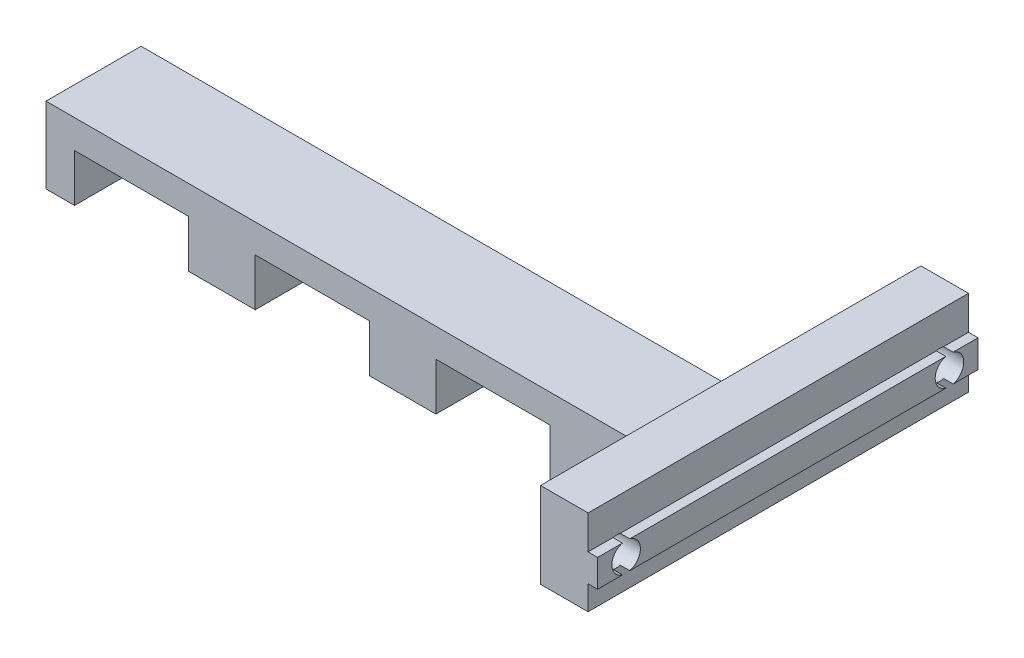
ISO-10303-21;
HEADER;
FILE_DESCRIPTION(('STEP AP214'),'2;1');
FILE_NAME('part.step','',(''),(''),'','','');
FILE_SCHEMA(('AUTOMOTIVE_DESIGN { 1 0 10303 214 1 1 1 1 }'));
ENDSEC;
DATA;
#1=APPLICATION_CONTEXT('core data for automotive mechanical design processes');
#2=APPLICATION_PROTOCOL_DEFINITION('international standard','automotive_design',2000,#1);
#3=PRODUCT_CONTEXT('',#1,'mechanical');
#4=PRODUCT('Part','Part','',(#3));
#5=PRODUCT_RELATED_PRODUCT_CATEGORY('part','',(#4));
#6=PRODUCT_DEFINITION_FORMATION('','',#4);
#7=PRODUCT_DEFINITION_CONTEXT('part definition',#1,'design');
#8=PRODUCT_DEFINITION('design','',#6,#7);
#9=PRODUCT_DEFINITION_SHAPE('','',#8);
#10=(LENGTH_UNIT() NAMED_UNIT(*) SI_UNIT(.MILLI.,.METRE.));
#11=(NAMED_UNIT(*) PLANE_ANGLE_UNIT() SI_UNIT($,.RADIAN.));
#12=(NAMED_UNIT(*) SI_UNIT($,.STERADIAN.) SOLID_ANGLE_UNIT());
#13=UNCERTAINTY_MEASURE_WITH_UNIT(LENGTH_MEASURE(1.E-05),#10,'distance_accuracy_value','');
#14=(GEOMETRIC_REPRESENTATION_CONTEXT(3) GLOBAL_UNCERTAINTY_ASSIGNED_CONTEXT((#13)) GLOBAL_UNIT_ASSIGNED_CONTEXT((#10,
#11,#12)) REPRESENTATION_CONTEXT('',''));
#15=CARTESIAN_POINT('',(0.,0.,0.));
#16=DIRECTION('',(0.,0.,1.));
#17=DIRECTION('',(1.,0.,0.));
#18=AXIS2_PLACEMENT_3D('',#15,#16,#17);
#19=CARTESIAN_POINT('',(73.,10.45,20.));
#20=DIRECTION('',(-1.,0.,0.));
#21=DIRECTION('',(0.,0.,1.));
#22=AXIS2_PLACEMENT_3D('',#19,#20,#21);
#23=PLANE('',#22);
#24=DIRECTION('',(0.,0.,-1.));
#25=VECTOR('',#24,1.);
#26=CARTESIAN_POINT('',(73.,10.45,20.));
#27=LINE('',#26,#25);
#28=CARTESIAN_POINT('',(73.,10.45,-17.3840572873934));
#29=VERTEX_POINT('',#28);
#30=CARTESIAN_POINT('',(73.,10.45,-20.));
#31=VERTEX_POINT('',#30);
#32=EDGE_CURVE('E286',#29,#31,#27,.T.);
#33=ORIENTED_EDGE('',*,*,#32,.F.);
#34=CARTESIAN_POINT('',(73.,9.,-17.));
#35=DIRECTION('',(1.,0.,0.));
#36=DIRECTION('',(0.,0.,-1.));
#37=AXIS2_PLACEMENT_3D('',#34,#35,#36);
#38=CIRCLE('',#37,1.5);
#39=CARTESIAN_POINT('',(73.,7.55,-17.3840572873934));
#40=VERTEX_POINT('',#39);
#41=EDGE_CURVE('E269',#40,#29,#38,.T.);
#42=ORIENTED_EDGE('',*,*,#41,.F.);
#43=DIRECTION('',(0.,0.,-1.));
#44=VECTOR('',#43,1.);
#45=CARTESIAN_POINT('',(73.,7.55,20.));
#46=LINE('',#45,#44);
#47=CARTESIAN_POINT('',(73.,7.55,-20.));
#48=VERTEX_POINT('',#47);
#49=EDGE_CURVE('E304',#40,#48,#46,.T.);
#50=ORIENTED_EDGE('',*,*,#49,.T.);
#51=DIRECTION('',(0.,1.,0.));
#52=VECTOR('',#51,1.);
#53=CARTESIAN_POINT('',(73.,10.45,-20.));
#54=LINE('',#53,#52);
#55=EDGE_CURVE('E292',#48,#31,#54,.T.);
#56=ORIENTED_EDGE('',*,*,#55,.T.);
#57=EDGE_LOOP('',(#33,#42,#50,#56));
#58=FACE_BOUND('',#57,.T.);
#59=ADVANCED_FACE('F33',(#58),#23,.F.);
#60=CARTESIAN_POINT('',(72.,10.45,20.));
#61=DIRECTION('',(0.,-1.,0.));
#62=DIRECTION('',(0.,0.,-1.));
#63=AXIS2_PLACEMENT_3D('',#60,#61,#62);
#64=PLANE('',#63);
#65=DIRECTION('',(0.,0.,-1.));
#66=VECTOR('',#65,1.);
#67=CARTESIAN_POINT('',(72.,10.45,20.));
#68=LINE('',#67,#66);
#69=CARTESIAN_POINT('',(72.,10.45,-17.3840572873934));
#70=VERTEX_POINT('',#69);
#71=CARTESIAN_POINT('',(72.,10.45,-20.));
#72=VERTEX_POINT('',#71);
#73=EDGE_CURVE('E288',#70,#72,#68,.T.);
#74=ORIENTED_EDGE('',*,*,#73,.F.);
#75=DIRECTION('',(1.,0.,0.));
#76=VECTOR('',#75,1.);
#77=CARTESIAN_POINT('',(43.,10.45,-17.3840572873934));
#78=LINE('',#77,#76);
#79=EDGE_CURVE('E273',#70,#29,#78,.T.);
#80=ORIENTED_EDGE('',*,*,#79,.T.);
#81=ORIENTED_EDGE('',*,*,#32,.T.);
#82=DIRECTION('',(-1.,0.,0.));
#83=VECTOR('',#82,1.);
#84=CARTESIAN_POINT('',(72.,10.45,-20.));
#85=LINE('',#84,#83);
#86=EDGE_CURVE('E515',#31,#72,#85,.T.);
#87=ORIENTED_EDGE('',*,*,#86,.T.);
#88=EDGE_LOOP('',(#74,#80,#81,#87));
#89=FACE_BOUND('',#88,.T.);
#90=ADVANCED_FACE('F284',(#89),#64,.F.);
#91=CARTESIAN_POINT('',(73.,7.55,20.));
#92=DIRECTION('',(0.,1.,0.));
#93=DIRECTION('',(0.,0.,1.));
#94=AXIS2_PLACEMENT_3D('',#91,#92,#93);
#95=PLANE('',#94);
#96=DIRECTION('',(0.,0.,-1.));
#97=VECTOR('',#96,1.);
#98=CARTESIAN_POINT('',(72.,7.55,20.));
#99=LINE('',#98,#97);
#100=CARTESIAN_POINT('',(72.,7.55,16.6159427126066));
#101=VERTEX_POINT('',#100);
#102=CARTESIAN_POINT('',(72.,7.55,-16.6159427126066));
#103=VERTEX_POINT('',#102);
#104=EDGE_CURVE('E320',#101,#103,#99,.T.);
#105=ORIENTED_EDGE('',*,*,#104,.T.);
#106=DIRECTION('',(1.,0.,0.));
#107=VECTOR('',#106,1.);
#108=CARTESIAN_POINT('',(43.,7.55,-16.6159427126066));
#109=LINE('',#108,#107);
#110=CARTESIAN_POINT('',(73.,7.55,-16.6159427126066));
#111=VERTEX_POINT('',#110);
#112=EDGE_CURVE('E545',#103,#111,#109,.T.);
#113=ORIENTED_EDGE('',*,*,#112,.T.);
#114=CARTESIAN_POINT('',(73.,7.55,16.6159427126066));
#115=VERTEX_POINT('',#114);
#116=EDGE_CURVE('E309',#115,#111,#46,.T.);
#117=ORIENTED_EDGE('',*,*,#116,.F.);
#118=DIRECTION('',(1.,0.,0.));
#119=VECTOR('',#118,1.);
#120=CARTESIAN_POINT('',(43.,7.55,16.6159427126066));
#121=LINE('',#120,#119);
#122=EDGE_CURVE('E557',#115,#101,#121,.F.);
#123=ORIENTED_EDGE('',*,*,#122,.T.);
#124=EDGE_LOOP('',(#105,#113,#117,#123));
#125=FACE_BOUND('',#124,.T.);
#126=ADVANCED_FACE('F681',(#125),#95,.F.);
#127=CARTESIAN_POINT('',(72.,7.55,20.));
#128=VERTEX_POINT('',#127);
#129=CARTESIAN_POINT('',(72.,7.55,17.3840572873934));
#130=VERTEX_POINT('',#129);
#131=EDGE_CURVE('E321',#128,#130,#99,.T.);
#132=ORIENTED_EDGE('',*,*,#131,.T.);
#133=DIRECTION('',(1.,0.,0.));
#134=VECTOR('',#133,1.);
#135=CARTESIAN_POINT('',(43.,7.55,17.3840572873934));
#136=LINE('',#135,#134);
#137=CARTESIAN_POINT('',(73.,7.55,17.3840572873934));
#138=VERTEX_POINT('',#137);
#139=EDGE_CURVE('E505',#130,#138,#136,.T.);
#140=ORIENTED_EDGE('',*,*,#139,.T.);
#141=CARTESIAN_POINT('',(73.,7.55,20.));
#142=VERTEX_POINT('',#141);
#143=EDGE_CURVE('E310',#142,#138,#46,.T.);
#144=ORIENTED_EDGE('',*,*,#143,.F.);
#145=DIRECTION('',(1.,0.,0.));
#146=VECTOR('',#145,1.);
#147=CARTESIAN_POINT('',(73.,7.55,20.));
#148=LINE('',#147,#146);
#149=EDGE_CURVE('E571',#128,#142,#148,.T.);
#150=ORIENTED_EDGE('',*,*,#149,.F.);
#151=EDGE_LOOP('',(#132,#140,#144,#150));
#152=FACE_BOUND('',#151,.T.);
#153=ADVANCED_FACE('F686',(#152),#95,.F.);
#154=ORIENTED_EDGE('',*,*,#116,.T.);
#155=CARTESIAN_POINT('',(73.,10.45,-16.6159427126066));
#156=VERTEX_POINT('',#155);
#157=EDGE_CURVE('E280',#156,#111,#38,.T.);
#158=ORIENTED_EDGE('',*,*,#157,.F.);
#159=CARTESIAN_POINT('',(73.,10.45,16.6159427126066));
#160=VERTEX_POINT('',#159);
#161=EDGE_CURVE('E294',#160,#156,#27,.T.);
#162=ORIENTED_EDGE('',*,*,#161,.F.);
#163=CARTESIAN_POINT('',(73.,9.,17.));
#164=DIRECTION('',(1.,0.,0.));
#165=DIRECTION('',(0.,0.,-1.));
#166=AXIS2_PLACEMENT_3D('',#163,#164,#165);
#167=CIRCLE('',#166,1.5);
#168=EDGE_CURVE('E551',#115,#160,#167,.T.);
#169=ORIENTED_EDGE('',*,*,#168,.F.);
#170=EDGE_LOOP('',(#154,#158,#162,#169));
#171=FACE_BOUND('',#170,.T.);
#172=ADVANCED_FACE('F676',(#171),#23,.F.);
#173=ORIENTED_EDGE('',*,*,#161,.T.);
#174=DIRECTION('',(1.,0.,0.));
#175=VECTOR('',#174,1.);
#176=CARTESIAN_POINT('',(43.,10.45,-16.6159427126066));
#177=LINE('',#176,#175);
#178=CARTESIAN_POINT('',(72.,10.45,-16.6159427126066));
#179=VERTEX_POINT('',#178);
#180=EDGE_CURVE('E289',#156,#179,#177,.F.);
#181=ORIENTED_EDGE('',*,*,#180,.T.);
#182=CARTESIAN_POINT('',(72.,10.45,16.6159427126066));
#183=VERTEX_POINT('',#182);
#184=EDGE_CURVE('E300',#183,#179,#68,.T.);
#185=ORIENTED_EDGE('',*,*,#184,.F.);
#186=DIRECTION('',(1.,0.,0.));
#187=VECTOR('',#186,1.);
#188=CARTESIAN_POINT('',(43.,10.45,16.6159427126066));
#189=LINE('',#188,#187);
#190=EDGE_CURVE('E536',#183,#160,#189,.T.);
#191=ORIENTED_EDGE('',*,*,#190,.T.);
#192=EDGE_LOOP('',(#173,#181,#185,#191));
#193=FACE_BOUND('',#192,.T.);
#194=ADVANCED_FACE('F535',(#193),#64,.F.);
#195=CARTESIAN_POINT('',(72.,5.,5.));
#196=DIRECTION('',(-1.,0.,0.));
#197=DIRECTION('',(0.,0.,1.));
#198=AXIS2_PLACEMENT_3D('',#195,#196,#197);
#199=PLANE('',#198);
#200=CARTESIAN_POINT('',(72.,7.55,-17.3840572873934));
#201=VERTEX_POINT('',#200);
#202=CARTESIAN_POINT('',(72.,7.55,-20.));
#203=VERTEX_POINT('',#202);
#204=EDGE_CURVE('E315',#201,#203,#99,.T.);
#205=ORIENTED_EDGE('',*,*,#204,.F.);
#206=CARTESIAN_POINT('',(72.,9.,-17.));
#207=DIRECTION('',(-1.,0.,0.));
#208=DIRECTION('',(0.,0.,1.));
#209=AXIS2_PLACEMENT_3D('',#206,#207,#208);
#210=CIRCLE('',#209,1.5);
#211=EDGE_CURVE('E542',#201,#103,#210,.T.);
#212=ORIENTED_EDGE('',*,*,#211,.T.);
#213=ORIENTED_EDGE('',*,*,#104,.F.);
#214=CARTESIAN_POINT('',(72.,9.,17.));
#215=DIRECTION('',(-1.,0.,0.));
#216=DIRECTION('',(0.,0.,1.));
#217=AXIS2_PLACEMENT_3D('',#214,#215,#216);
#218=CIRCLE('',#217,1.5);
#219=EDGE_CURVE('E560',#101,#130,#218,.T.);
#220=ORIENTED_EDGE('',*,*,#219,.T.);
#221=ORIENTED_EDGE('',*,*,#131,.F.);
#222=DIRECTION('',(0.,1.,0.));
#223=VECTOR('',#222,1.);
#224=CARTESIAN_POINT('',(72.,7.55,20.));
#225=LINE('',#224,#223);
#226=CARTESIAN_POINT('',(72.,5.,20.));
#227=VERTEX_POINT('',#226);
#228=EDGE_CURVE('E569',#227,#128,#225,.T.);
#229=ORIENTED_EDGE('',*,*,#228,.F.);
#230=DIRECTION('',(0.,0.,-1.));
#231=VECTOR('',#230,1.);
#232=CARTESIAN_POINT('',(72.,5.,5.));
#233=LINE('',#232,#231);
#234=CARTESIAN_POINT('',(72.,5.,-20.));
#235=VERTEX_POINT('',#234);
#236=EDGE_CURVE('E414',#227,#235,#233,.T.);
#237=ORIENTED_EDGE('',*,*,#236,.T.);
#238=DIRECTION('',(0.,1.,0.));
#239=VECTOR('',#238,1.);
#240=CARTESIAN_POINT('',(72.,7.55,-20.));
#241=LINE('',#240,#239);
#242=EDGE_CURVE('E502',#235,#203,#241,.T.);
#243=ORIENTED_EDGE('',*,*,#242,.T.);
#244=EDGE_LOOP('',(#205,#212,#213,#220,#221,#229,#237,#243));
#245=FACE_BOUND('',#244,.T.);
#246=ADVANCED_FACE('F716',(#245),#199,.F.);
#247=CARTESIAN_POINT('',(72.,8.00000000000001,5.));
#248=DIRECTION('',(0.,-1.,0.));
#249=DIRECTION('',(1.,0.,0.));
#250=AXIS2_PLACEMENT_3D('',#247,#248,#249);
#251=PLANE('',#250);
#252=DIRECTION('',(-1.,0.,0.));
#253=VECTOR('',#252,1.);
#254=CARTESIAN_POINT('',(72.,8.00000000000001,5.));
#255=LINE('',#254,#253);
#256=CARTESIAN_POINT('',(65.,8.00000000000001,5.));
#257=VERTEX_POINT('',#256);
#258=CARTESIAN_POINT('',(0.,8.,5.));
#259=VERTEX_POINT('',#258);
#260=EDGE_CURVE('E371',#257,#259,#255,.T.);
#261=ORIENTED_EDGE('',*,*,#260,.F.);
#262=DIRECTION('',(0.,0.,1.));
#263=VECTOR('',#262,1.);
#264=CARTESIAN_POINT('',(65.,8.00000000000001,-5.));
#265=LINE('',#264,#263);
#266=CARTESIAN_POINT('',(65.,8.00000000000001,-5.));
#267=VERTEX_POINT('',#266);
#268=EDGE_CURVE('E470',#257,#267,#265,.F.);
#269=ORIENTED_EDGE('',*,*,#268,.T.);
#270=DIRECTION('',(-1.,0.,0.));
#271=VECTOR('',#270,1.);
#272=CARTESIAN_POINT('',(72.,8.00000000000001,-5.));
#273=LINE('',#272,#271);
#274=CARTESIAN_POINT('',(0.,8.,-5.));
#275=VERTEX_POINT('',#274);
#276=EDGE_CURVE('E406',#267,#275,#273,.T.);
#277=ORIENTED_EDGE('',*,*,#276,.T.);
#278=DIRECTION('',(0.,0.,-1.));
#279=VECTOR('',#278,1.);
#280=CARTESIAN_POINT('',(0.,8.,5.));
#281=LINE('',#280,#279);
#282=EDGE_CURVE('E411',#259,#275,#281,.T.);
#283=ORIENTED_EDGE('',*,*,#282,.F.);
#284=EDGE_LOOP('',(#261,#269,#277,#283));
#285=FACE_BOUND('',#284,.T.);
#286=ADVANCED_FACE('F590',(#285),#251,.F.);
#287=CARTESIAN_POINT('',(0.,0.,5.));
#288=DIRECTION('',(0.,0.,1.));
#289=DIRECTION('',(1.,0.,0.));
#290=AXIS2_PLACEMENT_3D('',#287,#288,#289);
#291=PLANE('',#290);
#292=DIRECTION('',(1.,0.,0.));
#293=VECTOR('',#292,1.);
#294=CARTESIAN_POINT('',(60.,5.,5.));
#295=LINE('',#294,#293);
#296=CARTESIAN_POINT('',(60.,5.,5.));
#297=VERTEX_POINT('',#296);
#298=CARTESIAN_POINT('',(65.,5.,5.));
#299=VERTEX_POINT('',#298);
#300=EDGE_CURVE('E369',#297,#299,#295,.T.);
#301=ORIENTED_EDGE('',*,*,#300,.T.);
#302=DIRECTION('',(0.,1.,0.));
#303=VECTOR('',#302,1.);
#304=CARTESIAN_POINT('',(65.,0.,5.));
#305=LINE('',#304,#303);
#306=EDGE_CURVE('E472',#299,#257,#305,.T.);
#307=ORIENTED_EDGE('',*,*,#306,.T.);
#308=ORIENTED_EDGE('',*,*,#260,.T.);
#309=DIRECTION('',(0.,-1.,0.));
#310=VECTOR('',#309,1.);
#311=CARTESIAN_POINT('',(0.,8.,5.));
#312=LINE('',#311,#310);
#313=CARTESIAN_POINT('',(0.,0.,5.));
#314=VERTEX_POINT('',#313);
#315=EDGE_CURVE('E373',#259,#314,#312,.T.);
#316=ORIENTED_EDGE('',*,*,#315,.T.);
#317=DIRECTION('',(1.,0.,0.));
#318=VECTOR('',#317,1.);
#319=CARTESIAN_POINT('',(0.,0.,5.));
#320=LINE('',#319,#318);
#321=CARTESIAN_POINT('',(3.,0.,5.));
#322=VERTEX_POINT('',#321);
#323=EDGE_CURVE('E339',#314,#322,#320,.T.);
#324=ORIENTED_EDGE('',*,*,#323,.T.);
#325=DIRECTION('',(0.,1.,0.));
#326=VECTOR('',#325,1.);
#327=CARTESIAN_POINT('',(3.,0.,5.));
#328=LINE('',#327,#326);
#329=CARTESIAN_POINT('',(3.,5.,5.));
#330=VERTEX_POINT('',#329);
#331=EDGE_CURVE('E342',#322,#330,#328,.T.);
#332=ORIENTED_EDGE('',*,*,#331,.T.);
#333=DIRECTION('',(1.,0.,0.));
#334=VECTOR('',#333,1.);
#335=CARTESIAN_POINT('',(3.,5.,5.));
#336=LINE('',#335,#334);
#337=CARTESIAN_POINT('',(15.,5.,5.));
#338=VERTEX_POINT('',#337);
#339=EDGE_CURVE('E345',#330,#338,#336,.T.);
#340=ORIENTED_EDGE('',*,*,#339,.T.);
#341=DIRECTION('',(0.,-1.,0.));
#342=VECTOR('',#341,1.);
#343=CARTESIAN_POINT('',(15.,5.,5.));
#344=LINE('',#343,#342);
#345=CARTESIAN_POINT('',(15.,0.,5.));
#346=VERTEX_POINT('',#345);
#347=EDGE_CURVE('E347',#338,#346,#344,.T.);
#348=ORIENTED_EDGE('',*,*,#347,.T.);
#349=DIRECTION('',(1.,0.,0.));
#350=VECTOR('',#349,1.);
#351=CARTESIAN_POINT('',(15.,0.,5.));
#352=LINE('',#351,#350);
#353=CARTESIAN_POINT('',(22.,0.,5.));
#354=VERTEX_POINT('',#353);
#355=EDGE_CURVE('E349',#346,#354,#352,.T.);
#356=ORIENTED_EDGE('',*,*,#355,.T.);
#357=DIRECTION('',(0.,1.,0.));
#358=VECTOR('',#357,1.);
#359=CARTESIAN_POINT('',(22.,0.,5.));
#360=LINE('',#359,#358);
#361=CARTESIAN_POINT('',(22.,5.,5.));
#362=VERTEX_POINT('',#361);
#363=EDGE_CURVE('E351',#354,#362,#360,.T.);
#364=ORIENTED_EDGE('',*,*,#363,.T.);
#365=DIRECTION('',(1.,0.,0.));
#366=VECTOR('',#365,1.);
#367=CARTESIAN_POINT('',(22.,5.,5.));
#368=LINE('',#367,#366);
#369=CARTESIAN_POINT('',(34.,5.,5.));
#370=VERTEX_POINT('',#369);
#371=EDGE_CURVE('E353',#362,#370,#368,.T.);
#372=ORIENTED_EDGE('',*,*,#371,.T.);
#373=DIRECTION('',(0.,-1.,0.));
#374=VECTOR('',#373,1.);
#375=CARTESIAN_POINT('',(34.,5.,5.));
#376=LINE('',#375,#374);
#377=CARTESIAN_POINT('',(34.,0.,5.));
#378=VERTEX_POINT('',#377);
#379=EDGE_CURVE('E355',#370,#378,#376,.T.);
#380=ORIENTED_EDGE('',*,*,#379,.T.);
#381=DIRECTION('',(1.,0.,0.));
#382=VECTOR('',#381,1.);
#383=CARTESIAN_POINT('',(34.,0.,5.));
#384=LINE('',#383,#382);
#385=CARTESIAN_POINT('',(41.,0.,5.));
#386=VERTEX_POINT('',#385);
#387=EDGE_CURVE('E357',#378,#386,#384,.T.);
#388=ORIENTED_EDGE('',*,*,#387,.T.);
#389=DIRECTION('',(0.,1.,0.));
#390=VECTOR('',#389,1.);
#391=CARTESIAN_POINT('',(41.,0.,5.));
#392=LINE('',#391,#390);
#393=CARTESIAN_POINT('',(41.,5.,5.));
#394=VERTEX_POINT('',#393);
#395=EDGE_CURVE('E359',#386,#394,#392,.T.);
#396=ORIENTED_EDGE('',*,*,#395,.T.);
#397=DIRECTION('',(1.,0.,0.));
#398=VECTOR('',#397,1.);
#399=CARTESIAN_POINT('',(41.,5.,5.));
#400=LINE('',#399,#398);
#401=CARTESIAN_POINT('',(53.,5.,5.));
#402=VERTEX_POINT('',#401);
#403=EDGE_CURVE('E361',#394,#402,#400,.T.);
#404=ORIENTED_EDGE('',*,*,#403,.T.);
#405=DIRECTION('',(0.,-1.,0.));
#406=VECTOR('',#405,1.);
#407=CARTESIAN_POINT('',(53.,5.,5.));
#408=LINE('',#407,#406);
#409=CARTESIAN_POINT('',(53.,0.,5.));
#410=VERTEX_POINT('',#409);
#411=EDGE_CURVE('E363',#402,#410,#408,.T.);
#412=ORIENTED_EDGE('',*,*,#411,.T.);
#413=DIRECTION('',(1.,0.,0.));
#414=VECTOR('',#413,1.);
#415=CARTESIAN_POINT('',(53.,0.,5.));
#416=LINE('',#415,#414);
#417=CARTESIAN_POINT('',(60.,0.,5.));
#418=VERTEX_POINT('',#417);
#419=EDGE_CURVE('E365',#410,#418,#416,.T.);
#420=ORIENTED_EDGE('',*,*,#419,.T.);
#421=DIRECTION('',(0.,1.,0.));
#422=VECTOR('',#421,1.);
#423=CARTESIAN_POINT('',(60.,0.,5.));
#424=LINE('',#423,#422);
#425=EDGE_CURVE('E367',#418,#297,#424,.T.);
#426=ORIENTED_EDGE('',*,*,#425,.T.);
#427=EDGE_LOOP('',(#301,#307,#308,#316,#324,#332,#340,#348,#356,#364,#372,#380,#388,#396,#404,
#412,#420,#426));
#428=FACE_BOUND('',#427,.T.);
#429=ADVANCED_FACE('F587',(#428),#291,.T.);
#430=CARTESIAN_POINT('',(0.,0.,-5.));
#431=DIRECTION('',(0.,0.,1.));
#432=DIRECTION('',(1.,0.,0.));
#433=AXIS2_PLACEMENT_3D('',#430,#431,#432);
#434=PLANE('',#433);
#435=ORIENTED_EDGE('',*,*,#276,.F.);
#436=DIRECTION('',(0.,1.,0.));
#437=VECTOR('',#436,1.);
#438=CARTESIAN_POINT('',(65.,5.,-5.));
#439=LINE('',#438,#437);
#440=CARTESIAN_POINT('',(65.,5.,-5.));
#441=VERTEX_POINT('',#440);
#442=EDGE_CURVE('E50',#267,#441,#439,.F.);
#443=ORIENTED_EDGE('',*,*,#442,.T.);
#444=DIRECTION('',(1.,0.,0.));
#445=VECTOR('',#444,1.);
#446=CARTESIAN_POINT('',(60.,5.,-5.));
#447=LINE('',#446,#445);
#448=CARTESIAN_POINT('',(60.,5.,-5.));
#449=VERTEX_POINT('',#448);
#450=EDGE_CURVE('E404',#449,#441,#447,.T.);
#451=ORIENTED_EDGE('',*,*,#450,.F.);
#452=DIRECTION('',(0.,1.,0.));
#453=VECTOR('',#452,1.);
#454=CARTESIAN_POINT('',(60.,0.,-5.));
#455=LINE('',#454,#453);
#456=CARTESIAN_POINT('',(60.,0.,-5.));
#457=VERTEX_POINT('',#456);
#458=EDGE_CURVE('E402',#457,#449,#455,.T.);
#459=ORIENTED_EDGE('',*,*,#458,.F.);
#460=DIRECTION('',(1.,0.,0.));
#461=VECTOR('',#460,1.);
#462=CARTESIAN_POINT('',(53.,0.,-5.));
#463=LINE('',#462,#461);
#464=CARTESIAN_POINT('',(53.,0.,-5.));
#465=VERTEX_POINT('',#464);
#466=EDGE_CURVE('E400',#465,#457,#463,.T.);
#467=ORIENTED_EDGE('',*,*,#466,.F.);
#468=DIRECTION('',(0.,-1.,0.));
#469=VECTOR('',#468,1.);
#470=CARTESIAN_POINT('',(53.,5.,-5.));
#471=LINE('',#470,#469);
#472=CARTESIAN_POINT('',(53.,5.,-5.));
#473=VERTEX_POINT('',#472);
#474=EDGE_CURVE('E398',#473,#465,#471,.T.);
#475=ORIENTED_EDGE('',*,*,#474,.F.);
#476=DIRECTION('',(1.,0.,0.));
#477=VECTOR('',#476,1.);
#478=CARTESIAN_POINT('',(41.,5.,-5.));
#479=LINE('',#478,#477);
#480=CARTESIAN_POINT('',(41.,5.,-5.));
#481=VERTEX_POINT('',#480);
#482=EDGE_CURVE('E396',#481,#473,#479,.T.);
#483=ORIENTED_EDGE('',*,*,#482,.F.);
#484=DIRECTION('',(0.,1.,0.));
#485=VECTOR('',#484,1.);
#486=CARTESIAN_POINT('',(41.,0.,-5.));
#487=LINE('',#486,#485);
#488=CARTESIAN_POINT('',(41.,0.,-5.));
#489=VERTEX_POINT('',#488);
#490=EDGE_CURVE('E394',#489,#481,#487,.T.);
#491=ORIENTED_EDGE('',*,*,#490,.F.);
#492=DIRECTION('',(1.,0.,0.));
#493=VECTOR('',#492,1.);
#494=CARTESIAN_POINT('',(34.,0.,-5.));
#495=LINE('',#494,#493);
#496=CARTESIAN_POINT('',(34.,0.,-5.));
#497=VERTEX_POINT('',#496);
#498=EDGE_CURVE('E392',#497,#489,#495,.T.);
#499=ORIENTED_EDGE('',*,*,#498,.F.);
#500=DIRECTION('',(0.,-1.,0.));
#501=VECTOR('',#500,1.);
#502=CARTESIAN_POINT('',(34.,5.,-5.));
#503=LINE('',#502,#501);
#504=CARTESIAN_POINT('',(34.,5.,-5.));
#505=VERTEX_POINT('',#504);
#506=EDGE_CURVE('E390',#505,#497,#503,.T.);
#507=ORIENTED_EDGE('',*,*,#506,.F.);
#508=DIRECTION('',(1.,0.,0.));
#509=VECTOR('',#508,1.);
#510=CARTESIAN_POINT('',(22.,5.,-5.));
#511=LINE('',#510,#509);
#512=CARTESIAN_POINT('',(22.,5.,-5.));
#513=VERTEX_POINT('',#512);
#514=EDGE_CURVE('E388',#513,#505,#511,.T.);
#515=ORIENTED_EDGE('',*,*,#514,.F.);
#516=DIRECTION('',(0.,1.,0.));
#517=VECTOR('',#516,1.);
#518=CARTESIAN_POINT('',(22.,0.,-5.));
#519=LINE('',#518,#517);
#520=CARTESIAN_POINT('',(22.,0.,-5.));
#521=VERTEX_POINT('',#520);
#522=EDGE_CURVE('E386',#521,#513,#519,.T.);
#523=ORIENTED_EDGE('',*,*,#522,.F.);
#524=DIRECTION('',(1.,0.,0.));
#525=VECTOR('',#524,1.);
#526=CARTESIAN_POINT('',(15.,0.,-5.));
#527=LINE('',#526,#525);
#528=CARTESIAN_POINT('',(15.,0.,-5.));
#529=VERTEX_POINT('',#528);
#530=EDGE_CURVE('E384',#529,#521,#527,.T.);
#531=ORIENTED_EDGE('',*,*,#530,.F.);
#532=DIRECTION('',(0.,-1.,0.));
#533=VECTOR('',#532,1.);
#534=CARTESIAN_POINT('',(15.,5.,-5.));
#535=LINE('',#534,#533);
#536=CARTESIAN_POINT('',(15.,5.,-5.));
#537=VERTEX_POINT('',#536);
#538=EDGE_CURVE('E382',#537,#529,#535,.T.);
#539=ORIENTED_EDGE('',*,*,#538,.F.);
#540=DIRECTION('',(1.,0.,0.));
#541=VECTOR('',#540,1.);
#542=CARTESIAN_POINT('',(3.,5.,-5.));
#543=LINE('',#542,#541);
#544=CARTESIAN_POINT('',(3.,5.,-5.));
#545=VERTEX_POINT('',#544);
#546=EDGE_CURVE('E380',#545,#537,#543,.T.);
#547=ORIENTED_EDGE('',*,*,#546,.F.);
#548=DIRECTION('',(0.,1.,0.));
#549=VECTOR('',#548,1.);
#550=CARTESIAN_POINT('',(3.,0.,-5.));
#551=LINE('',#550,#549);
#552=CARTESIAN_POINT('',(3.,0.,-5.));
#553=VERTEX_POINT('',#552);
#554=EDGE_CURVE('E378',#553,#545,#551,.T.);
#555=ORIENTED_EDGE('',*,*,#554,.F.);
#556=DIRECTION('',(1.,0.,0.));
#557=VECTOR('',#556,1.);
#558=CARTESIAN_POINT('',(0.,0.,-5.));
#559=LINE('',#558,#557);
#560=CARTESIAN_POINT('',(0.,0.,-5.));
#561=VERTEX_POINT('',#560);
#562=EDGE_CURVE('E337',#561,#553,#559,.T.);
#563=ORIENTED_EDGE('',*,*,#562,.F.);
#564=DIRECTION('',(0.,-1.,0.));
#565=VECTOR('',#564,1.);
#566=CARTESIAN_POINT('',(0.,8.,-5.));
#567=LINE('',#566,#565);
#568=EDGE_CURVE('E343',#275,#561,#567,.T.);
#569=ORIENTED_EDGE('',*,*,#568,.F.);
#570=EDGE_LOOP('',(#435,#443,#451,#459,#467,#475,#483,#491,#499,#507,#515,#523,#531,#539,#547,
#555,#563,#569));
#571=FACE_BOUND('',#570,.T.);
#572=ADVANCED_FACE('F664',(#571),#434,.F.);
#573=CARTESIAN_POINT('',(0.,0.,5.));
#574=DIRECTION('',(0.,1.,0.));
#575=DIRECTION('',(0.,0.,1.));
#576=AXIS2_PLACEMENT_3D('',#573,#574,#575);
#577=PLANE('',#576);
#578=ORIENTED_EDGE('',*,*,#562,.T.);
#579=DIRECTION('',(0.,0.,-1.));
#580=VECTOR('',#579,1.);
#581=CARTESIAN_POINT('',(3.,0.,5.));
#582=LINE('',#581,#580);
#583=EDGE_CURVE('E455',#322,#553,#582,.T.);
#584=ORIENTED_EDGE('',*,*,#583,.F.);
#585=ORIENTED_EDGE('',*,*,#323,.F.);
#586=DIRECTION('',(0.,0.,-1.));
#587=VECTOR('',#586,1.);
#588=CARTESIAN_POINT('',(0.,0.,5.));
#589=LINE('',#588,#587);
#590=EDGE_CURVE('E375',#314,#561,#589,.T.);
#591=ORIENTED_EDGE('',*,*,#590,.T.);
#592=EDGE_LOOP('',(#578,#584,#585,#591));
#593=FACE_BOUND('',#592,.T.);
#594=ADVANCED_FACE('F600',(#593),#577,.F.);
#595=CARTESIAN_POINT('',(3.,0.,5.));
#596=DIRECTION('',(-1.,0.,0.));
#597=DIRECTION('',(0.,0.,1.));
#598=AXIS2_PLACEMENT_3D('',#595,#596,#597);
#599=PLANE('',#598);
#600=ORIENTED_EDGE('',*,*,#554,.T.);
#601=DIRECTION('',(0.,0.,-1.));
#602=VECTOR('',#601,1.);
#603=CARTESIAN_POINT('',(3.,5.,5.));
#604=LINE('',#603,#602);
#605=EDGE_CURVE('E452',#330,#545,#604,.T.);
#606=ORIENTED_EDGE('',*,*,#605,.F.);
#607=ORIENTED_EDGE('',*,*,#331,.F.);
#608=ORIENTED_EDGE('',*,*,#583,.T.);
#609=EDGE_LOOP('',(#600,#606,#607,#608));
#610=FACE_BOUND('',#609,.T.);
#611=ADVANCED_FACE('F603',(#610),#599,.F.);
#612=CARTESIAN_POINT('',(3.,5.,5.));
#613=DIRECTION('',(0.,1.,0.));
#614=DIRECTION('',(0.,0.,1.));
#615=AXIS2_PLACEMENT_3D('',#612,#613,#614);
#616=PLANE('',#615);
#617=ORIENTED_EDGE('',*,*,#546,.T.);
#618=DIRECTION('',(0.,0.,-1.));
#619=VECTOR('',#618,1.);
#620=CARTESIAN_POINT('',(15.,5.,5.));
#621=LINE('',#620,#619);
#622=EDGE_CURVE('E449',#338,#537,#621,.T.);
#623=ORIENTED_EDGE('',*,*,#622,.F.);
#624=ORIENTED_EDGE('',*,*,#339,.F.);
#625=ORIENTED_EDGE('',*,*,#605,.T.);
#626=EDGE_LOOP('',(#617,#623,#624,#625));
#627=FACE_BOUND('',#626,.T.);
#628=ADVANCED_FACE('F608',(#627),#616,.F.);
#629=CARTESIAN_POINT('',(15.,5.,5.));
#630=DIRECTION('',(1.,0.,0.));
#631=DIRECTION('',(0.,1.,0.));
#632=AXIS2_PLACEMENT_3D('',#629,#630,#631);
#633=PLANE('',#632);
#634=ORIENTED_EDGE('',*,*,#538,.T.);
#635=DIRECTION('',(0.,0.,-1.));
#636=VECTOR('',#635,1.);
#637=CARTESIAN_POINT('',(15.,0.,5.));
#638=LINE('',#637,#636);
#639=EDGE_CURVE('E446',#346,#529,#638,.T.);
#640=ORIENTED_EDGE('',*,*,#639,.F.);
#641=ORIENTED_EDGE('',*,*,#347,.F.);
#642=ORIENTED_EDGE('',*,*,#622,.T.);
#643=EDGE_LOOP('',(#634,#640,#641,#642));
#644=FACE_BOUND('',#643,.T.);
#645=ADVANCED_FACE('F614',(#644),#633,.F.);
#646=CARTESIAN_POINT('',(15.,0.,5.));
#647=DIRECTION('',(0.,1.,0.));
#648=DIRECTION('',(-1.,0.,0.));
#649=AXIS2_PLACEMENT_3D('',#646,#647,#648);
#650=PLANE('',#649);
#651=ORIENTED_EDGE('',*,*,#530,.T.);
#652=DIRECTION('',(0.,0.,-1.));
#653=VECTOR('',#652,1.);
#654=CARTESIAN_POINT('',(22.,0.,5.));
#655=LINE('',#654,#653);
#656=EDGE_CURVE('E443',#354,#521,#655,.T.);
#657=ORIENTED_EDGE('',*,*,#656,.F.);
#658=ORIENTED_EDGE('',*,*,#355,.F.);
#659=ORIENTED_EDGE('',*,*,#639,.T.);
#660=EDGE_LOOP('',(#651,#657,#658,#659));
#661=FACE_BOUND('',#660,.T.);
#662=ADVANCED_FACE('F618',(#661),#650,.F.);
#663=CARTESIAN_POINT('',(22.,0.,5.));
#664=DIRECTION('',(-1.,0.,0.));
#665=DIRECTION('',(0.,-1.,0.));
#666=AXIS2_PLACEMENT_3D('',#663,#664,#665);
#667=PLANE('',#666);
#668=ORIENTED_EDGE('',*,*,#522,.T.);
#669=DIRECTION('',(0.,0.,-1.));
#670=VECTOR('',#669,1.);
#671=CARTESIAN_POINT('',(22.,5.,5.));
#672=LINE('',#671,#670);
#673=EDGE_CURVE('E440',#362,#513,#672,.T.);
#674=ORIENTED_EDGE('',*,*,#673,.F.);
#675=ORIENTED_EDGE('',*,*,#363,.F.);
#676=ORIENTED_EDGE('',*,*,#656,.T.);
#677=EDGE_LOOP('',(#668,#674,#675,#676));
#678=FACE_BOUND('',#677,.T.);
#679=ADVANCED_FACE('F623',(#678),#667,.F.);
#680=CARTESIAN_POINT('',(22.,5.,5.));
#681=DIRECTION('',(0.,1.,0.));
#682=DIRECTION('',(0.,0.,1.));
#683=AXIS2_PLACEMENT_3D('',#680,#681,#682);
#684=PLANE('',#683);
#685=ORIENTED_EDGE('',*,*,#514,.T.);
#686=DIRECTION('',(0.,0.,-1.));
#687=VECTOR('',#686,1.);
#688=CARTESIAN_POINT('',(34.,5.,5.));
#689=LINE('',#688,#687);
#690=EDGE_CURVE('E437',#370,#505,#689,.T.);
#691=ORIENTED_EDGE('',*,*,#690,.F.);
#692=ORIENTED_EDGE('',*,*,#371,.F.);
#693=ORIENTED_EDGE('',*,*,#673,.T.);
#694=EDGE_LOOP('',(#685,#691,#692,#693));
#695=FACE_BOUND('',#694,.T.);
#696=ADVANCED_FACE('F629',(#695),#684,.F.);
#697=CARTESIAN_POINT('',(34.,5.,5.));
#698=DIRECTION('',(1.,0.,0.));
#699=DIRECTION('',(0.,1.,0.));
#700=AXIS2_PLACEMENT_3D('',#697,#698,#699);
#701=PLANE('',#700);
#702=ORIENTED_EDGE('',*,*,#506,.T.);
#703=DIRECTION('',(0.,0.,-1.));
#704=VECTOR('',#703,1.);
#705=CARTESIAN_POINT('',(34.,0.,5.));
#706=LINE('',#705,#704);
#707=EDGE_CURVE('E434',#378,#497,#706,.T.);
#708=ORIENTED_EDGE('',*,*,#707,.F.);
#709=ORIENTED_EDGE('',*,*,#379,.F.);
#710=ORIENTED_EDGE('',*,*,#690,.T.);
#711=EDGE_LOOP('',(#702,#708,#709,#710));
#712=FACE_BOUND('',#711,.T.);
#713=ADVANCED_FACE('F633',(#712),#701,.F.);
#714=CARTESIAN_POINT('',(34.,0.,5.));
#715=DIRECTION('',(0.,1.,0.));
#716=DIRECTION('',(0.,0.,1.));
#717=AXIS2_PLACEMENT_3D('',#714,#715,#716);
#718=PLANE('',#717);
#719=ORIENTED_EDGE('',*,*,#498,.T.);
#720=DIRECTION('',(0.,0.,-1.));
#721=VECTOR('',#720,1.);
#722=CARTESIAN_POINT('',(41.,0.,5.));
#723=LINE('',#722,#721);
#724=EDGE_CURVE('E431',#386,#489,#723,.T.);
#725=ORIENTED_EDGE('',*,*,#724,.F.);
#726=ORIENTED_EDGE('',*,*,#387,.F.);
#727=ORIENTED_EDGE('',*,*,#707,.T.);
#728=EDGE_LOOP('',(#719,#725,#726,#727));
#729=FACE_BOUND('',#728,.T.);
#730=ADVANCED_FACE('F638',(#729),#718,.F.);
#731=CARTESIAN_POINT('',(41.,0.,5.));
#732=DIRECTION('',(-1.,0.,0.));
#733=DIRECTION('',(0.,-1.,0.));
#734=AXIS2_PLACEMENT_3D('',#731,#732,#733);
#735=PLANE('',#734);
#736=ORIENTED_EDGE('',*,*,#490,.T.);
#737=DIRECTION('',(0.,0.,-1.));
#738=VECTOR('',#737,1.);
#739=CARTESIAN_POINT('',(41.,5.,5.));
#740=LINE('',#739,#738);
#741=EDGE_CURVE('E428',#394,#481,#740,.T.);
#742=ORIENTED_EDGE('',*,*,#741,.F.);
#743=ORIENTED_EDGE('',*,*,#395,.F.);
#744=ORIENTED_EDGE('',*,*,#724,.T.);
#745=EDGE_LOOP('',(#736,#742,#743,#744));
#746=FACE_BOUND('',#745,.T.);
#747=ADVANCED_FACE('F644',(#746),#735,.F.);
#748=CARTESIAN_POINT('',(41.,5.,5.));
#749=DIRECTION('',(0.,1.,0.));
#750=DIRECTION('',(0.,0.,1.));
#751=AXIS2_PLACEMENT_3D('',#748,#749,#750);
#752=PLANE('',#751);
#753=ORIENTED_EDGE('',*,*,#482,.T.);
#754=DIRECTION('',(0.,0.,-1.));
#755=VECTOR('',#754,1.);
#756=CARTESIAN_POINT('',(53.,5.,5.));
#757=LINE('',#756,#755);
#758=EDGE_CURVE('E425',#402,#473,#757,.T.);
#759=ORIENTED_EDGE('',*,*,#758,.F.);
#760=ORIENTED_EDGE('',*,*,#403,.F.);
#761=ORIENTED_EDGE('',*,*,#741,.T.);
#762=EDGE_LOOP('',(#753,#759,#760,#761));
#763=FACE_BOUND('',#762,.T.);
#764=ADVANCED_FACE('F648',(#763),#752,.F.);
#765=CARTESIAN_POINT('',(53.,5.,5.));
#766=DIRECTION('',(1.,0.,0.));
#767=DIRECTION('',(0.,1.,0.));
#768=AXIS2_PLACEMENT_3D('',#765,#766,#767);
#769=PLANE('',#768);
#770=ORIENTED_EDGE('',*,*,#474,.T.);
#771=DIRECTION('',(0.,0.,-1.));
#772=VECTOR('',#771,1.);
#773=CARTESIAN_POINT('',(53.,0.,5.));
#774=LINE('',#773,#772);
#775=EDGE_CURVE('E422',#410,#465,#774,.T.);
#776=ORIENTED_EDGE('',*,*,#775,.F.);
#777=ORIENTED_EDGE('',*,*,#411,.F.);
#778=ORIENTED_EDGE('',*,*,#758,.T.);
#779=EDGE_LOOP('',(#770,#776,#777,#778));
#780=FACE_BOUND('',#779,.T.);
#781=ADVANCED_FACE('F653',(#780),#769,.F.);
#782=CARTESIAN_POINT('',(53.,0.,5.));
#783=DIRECTION('',(0.,1.,0.));
#784=DIRECTION('',(0.,0.,1.));
#785=AXIS2_PLACEMENT_3D('',#782,#783,#784);
#786=PLANE('',#785);
#787=ORIENTED_EDGE('',*,*,#466,.T.);
#788=DIRECTION('',(0.,0.,-1.));
#789=VECTOR('',#788,1.);
#790=CARTESIAN_POINT('',(60.,0.,5.));
#791=LINE('',#790,#789);
#792=EDGE_CURVE('E419',#418,#457,#791,.T.);
#793=ORIENTED_EDGE('',*,*,#792,.F.);
#794=ORIENTED_EDGE('',*,*,#419,.F.);
#795=ORIENTED_EDGE('',*,*,#775,.T.);
#796=EDGE_LOOP('',(#787,#793,#794,#795));
#797=FACE_BOUND('',#796,.T.);
#798=ADVANCED_FACE('F659',(#797),#786,.F.);
#799=CARTESIAN_POINT('',(60.,0.,5.));
#800=DIRECTION('',(-1.,0.,0.));
#801=DIRECTION('',(0.,-1.,0.));
#802=AXIS2_PLACEMENT_3D('',#799,#800,#801);
#803=PLANE('',#802);
#804=ORIENTED_EDGE('',*,*,#458,.T.);
#805=DIRECTION('',(0.,0.,-1.));
#806=VECTOR('',#805,1.);
#807=CARTESIAN_POINT('',(60.,5.,5.));
#808=LINE('',#807,#806);
#809=EDGE_CURVE('E416',#297,#449,#808,.T.);
#810=ORIENTED_EDGE('',*,*,#809,.F.);
#811=ORIENTED_EDGE('',*,*,#425,.F.);
#812=ORIENTED_EDGE('',*,*,#792,.T.);
#813=EDGE_LOOP('',(#804,#810,#811,#812));
#814=FACE_BOUND('',#813,.T.);
#815=ADVANCED_FACE('F663',(#814),#803,.F.);
#816=CARTESIAN_POINT('',(60.,5.,5.));
#817=DIRECTION('',(0.,1.,0.));
#818=DIRECTION('',(0.,0.,1.));
#819=AXIS2_PLACEMENT_3D('',#816,#817,#818);
#820=PLANE('',#819);
#821=ORIENTED_EDGE('',*,*,#236,.F.);
#822=DIRECTION('',(1.,0.,0.));
#823=VECTOR('',#822,1.);
#824=CARTESIAN_POINT('',(72.,5.,20.));
#825=LINE('',#824,#823);
#826=CARTESIAN_POINT('',(67.,5.,20.));
#827=VERTEX_POINT('',#826);
#828=EDGE_CURVE('E566',#827,#227,#825,.T.);
#829=ORIENTED_EDGE('',*,*,#828,.F.);
#830=DIRECTION('',(0.,0.,-1.));
#831=VECTOR('',#830,1.);
#832=CARTESIAN_POINT('',(67.,5.,20.));
#833=LINE('',#832,#831);
#834=CARTESIAN_POINT('',(67.,5.,7.));
#835=VERTEX_POINT('',#834);
#836=EDGE_CURVE('E333',#827,#835,#833,.T.);
#837=ORIENTED_EDGE('',*,*,#836,.T.);
#838=CARTESIAN_POINT('',(65.,5.,7.));
#839=DIRECTION('',(0.,1.,0.));
#840=DIRECTION('',(0.,0.,1.));
#841=AXIS2_PLACEMENT_3D('',#838,#839,#840);
#842=CIRCLE('',#841,2.);
#843=EDGE_CURVE('E42',#835,#299,#842,.T.);
#844=ORIENTED_EDGE('',*,*,#843,.T.);
#845=ORIENTED_EDGE('',*,*,#300,.F.);
#846=ORIENTED_EDGE('',*,*,#809,.T.);
#847=ORIENTED_EDGE('',*,*,#450,.T.);
#848=CARTESIAN_POINT('',(65.,5.,-7.));
#849=DIRECTION('',(0.,1.,0.));
#850=DIRECTION('',(0.,0.,1.));
#851=AXIS2_PLACEMENT_3D('',#848,#849,#850);
#852=CIRCLE('',#851,2.);
#853=CARTESIAN_POINT('',(67.,5.,-7.));
#854=VERTEX_POINT('',#853);
#855=EDGE_CURVE('E11',#441,#854,#852,.T.);
#856=ORIENTED_EDGE('',*,*,#855,.T.);
#857=CARTESIAN_POINT('',(67.,5.,-20.));
#858=VERTEX_POINT('',#857);
#859=EDGE_CURVE('E328',#854,#858,#833,.T.);
#860=ORIENTED_EDGE('',*,*,#859,.T.);
#861=DIRECTION('',(1.,0.,0.));
#862=VECTOR('',#861,1.);
#863=CARTESIAN_POINT('',(72.,5.,-20.));
#864=LINE('',#863,#862);
#865=EDGE_CURVE('E499',#858,#235,#864,.T.);
#866=ORIENTED_EDGE('',*,*,#865,.T.);
#867=EDGE_LOOP('',(#821,#829,#837,#844,#845,#846,#847,#856,#860,#866));
#868=FACE_BOUND('',#867,.T.);
#869=ADVANCED_FACE('F487',(#868),#820,.F.);
#870=CARTESIAN_POINT('',(0.,8.,5.));
#871=DIRECTION('',(1.,0.,0.));
#872=DIRECTION('',(0.,1.,0.));
#873=AXIS2_PLACEMENT_3D('',#870,#871,#872);
#874=PLANE('',#873);
#875=ORIENTED_EDGE('',*,*,#568,.T.);
#876=ORIENTED_EDGE('',*,*,#590,.F.);
#877=ORIENTED_EDGE('',*,*,#315,.F.);
#878=ORIENTED_EDGE('',*,*,#282,.T.);
#879=EDGE_LOOP('',(#875,#876,#877,#878));
#880=FACE_BOUND('',#879,.T.);
#881=ADVANCED_FACE('F595',(#880),#874,.F.);
#882=CARTESIAN_POINT('',(67.,5.,20.));
#883=DIRECTION('',(1.,0.,0.));
#884=DIRECTION('',(0.,0.,-1.));
#885=AXIS2_PLACEMENT_3D('',#882,#883,#884);
#886=PLANE('',#885);
#887=CARTESIAN_POINT('',(67.,9.,-17.));
#888=DIRECTION('',(1.,0.,0.));
#889=DIRECTION('',(0.,0.,-1.));
#890=AXIS2_PLACEMENT_3D('',#887,#888,#889);
#891=CIRCLE('',#890,1.5);
#892=CARTESIAN_POINT('',(67.,9.,-18.5));
#893=VERTEX_POINT('',#892);
#894=EDGE_CURVE('E548',#893,#893,#891,.T.);
#895=ORIENTED_EDGE('',*,*,#894,.T.);
#896=EDGE_LOOP('',(#895));
#897=FACE_BOUND('',#896,.T.);
#898=CARTESIAN_POINT('',(67.,9.,17.));
#899=DIRECTION('',(1.,0.,0.));
#900=DIRECTION('',(0.,0.,-1.));
#901=AXIS2_PLACEMENT_3D('',#898,#899,#900);
#902=CIRCLE('',#901,1.5);
#903=CARTESIAN_POINT('',(67.,9.,15.5));
#904=VERTEX_POINT('',#903);
#905=EDGE_CURVE('E500',#904,#904,#902,.T.);
#906=ORIENTED_EDGE('',*,*,#905,.T.);
#907=EDGE_LOOP('',(#906));
#908=FACE_BOUND('',#907,.T.);
#909=DIRECTION('',(0.,0.,1.));
#910=VECTOR('',#909,1.);
#911=CARTESIAN_POINT('',(67.,10.,5.));
#912=LINE('',#911,#910);
#913=CARTESIAN_POINT('',(67.,10.,-7.));
#914=VERTEX_POINT('',#913);
#915=CARTESIAN_POINT('',(67.,10.,7.));
#916=VERTEX_POINT('',#915);
#917=EDGE_CURVE('E465',#914,#916,#912,.T.);
#918=ORIENTED_EDGE('',*,*,#917,.T.);
#919=DIRECTION('',(0.,1.,0.));
#920=VECTOR('',#919,1.);
#921=CARTESIAN_POINT('',(67.,5.,7.));
#922=LINE('',#921,#920);
#923=EDGE_CURVE('E468',#916,#835,#922,.F.);
#924=ORIENTED_EDGE('',*,*,#923,.T.);
#925=ORIENTED_EDGE('',*,*,#836,.F.);
#926=DIRECTION('',(0.,-1.,0.));
#927=VECTOR('',#926,1.);
#928=CARTESIAN_POINT('',(67.,5.,20.));
#929=LINE('',#928,#927);
#930=CARTESIAN_POINT('',(67.,14.,20.));
#931=VERTEX_POINT('',#930);
#932=EDGE_CURVE('E521',#931,#827,#929,.T.);
#933=ORIENTED_EDGE('',*,*,#932,.F.);
#934=DIRECTION('',(0.,0.,-1.));
#935=VECTOR('',#934,1.);
#936=CARTESIAN_POINT('',(67.,14.,20.));
#937=LINE('',#936,#935);
#938=CARTESIAN_POINT('',(67.,14.,-20.));
#939=VERTEX_POINT('',#938);
#940=EDGE_CURVE('E496',#931,#939,#937,.T.);
#941=ORIENTED_EDGE('',*,*,#940,.T.);
#942=DIRECTION('',(0.,-1.,0.));
#943=VECTOR('',#942,1.);
#944=CARTESIAN_POINT('',(67.,5.,-20.));
#945=LINE('',#944,#943);
#946=EDGE_CURVE('E493',#939,#858,#945,.T.);
#947=ORIENTED_EDGE('',*,*,#946,.T.);
#948=ORIENTED_EDGE('',*,*,#859,.F.);
#949=DIRECTION('',(0.,1.,0.));
#950=VECTOR('',#949,1.);
#951=CARTESIAN_POINT('',(67.,8.00000000000001,-7.));
#952=LINE('',#951,#950);
#953=EDGE_CURVE('E463',#854,#914,#952,.T.);
#954=ORIENTED_EDGE('',*,*,#953,.T.);
#955=EDGE_LOOP('',(#918,#924,#925,#933,#941,#947,#948,#954));
#956=FACE_BOUND('',#955,.T.);
#957=ADVANCED_FACE('F490',(#897,#908,#956),#886,.F.);
#958=ORIENTED_EDGE('',*,*,#49,.F.);
#959=DIRECTION('',(1.,0.,0.));
#960=VECTOR('',#959,1.);
#961=CARTESIAN_POINT('',(43.,7.55,-17.3840572873934));
#962=LINE('',#961,#960);
#963=EDGE_CURVE('E276',#40,#201,#962,.F.);
#964=ORIENTED_EDGE('',*,*,#963,.T.);
#965=ORIENTED_EDGE('',*,*,#204,.T.);
#966=DIRECTION('',(1.,0.,0.));
#967=VECTOR('',#966,1.);
#968=CARTESIAN_POINT('',(73.,7.55,-20.));
#969=LINE('',#968,#967);
#970=EDGE_CURVE('E512',#203,#48,#969,.T.);
#971=ORIENTED_EDGE('',*,*,#970,.T.);
#972=EDGE_LOOP('',(#958,#964,#965,#971));
#973=FACE_BOUND('',#972,.T.);
#974=ADVANCED_FACE('F689',(#973),#95,.F.);
#975=ORIENTED_EDGE('',*,*,#143,.T.);
#976=CARTESIAN_POINT('',(73.,10.45,17.3840572873934));
#977=VERTEX_POINT('',#976);
#978=EDGE_CURVE('E553',#977,#138,#167,.T.);
#979=ORIENTED_EDGE('',*,*,#978,.F.);
#980=CARTESIAN_POINT('',(73.,10.45,20.));
#981=VERTEX_POINT('',#980);
#982=EDGE_CURVE('E297',#981,#977,#27,.T.);
#983=ORIENTED_EDGE('',*,*,#982,.F.);
#984=DIRECTION('',(0.,1.,0.));
#985=VECTOR('',#984,1.);
#986=CARTESIAN_POINT('',(73.,10.45,20.));
#987=LINE('',#986,#985);
#988=EDGE_CURVE('E573',#142,#981,#987,.T.);
#989=ORIENTED_EDGE('',*,*,#988,.F.);
#990=EDGE_LOOP('',(#975,#979,#983,#989));
#991=FACE_BOUND('',#990,.T.);
#992=ADVANCED_FACE('F677',(#991),#23,.F.);
#993=ORIENTED_EDGE('',*,*,#982,.T.);
#994=DIRECTION('',(1.,0.,0.));
#995=VECTOR('',#994,1.);
#996=CARTESIAN_POINT('',(43.,10.45,17.3840572873934));
#997=LINE('',#996,#995);
#998=CARTESIAN_POINT('',(72.,10.45,17.3840572873934));
#999=VERTEX_POINT('',#998);
#1000=EDGE_CURVE('E554',#977,#999,#997,.F.);
#1001=ORIENTED_EDGE('',*,*,#1000,.T.);
#1002=CARTESIAN_POINT('',(72.,10.45,20.));
#1003=VERTEX_POINT('',#1002);
#1004=EDGE_CURVE('E295',#1003,#999,#68,.T.);
#1005=ORIENTED_EDGE('',*,*,#1004,.F.);
#1006=DIRECTION('',(-1.,0.,0.));
#1007=VECTOR('',#1006,1.);
#1008=CARTESIAN_POINT('',(72.,10.45,20.));
#1009=LINE('',#1008,#1007);
#1010=EDGE_CURVE('E575',#981,#1003,#1009,.T.);
#1011=ORIENTED_EDGE('',*,*,#1010,.F.);
#1012=EDGE_LOOP('',(#993,#1001,#1005,#1011));
#1013=FACE_BOUND('',#1012,.T.);
#1014=ADVANCED_FACE('F683',(#1013),#64,.F.);
#1015=CARTESIAN_POINT('',(72.,14.,20.));
#1016=DIRECTION('',(-1.,0.,0.));
#1017=DIRECTION('',(0.,0.,1.));
#1018=AXIS2_PLACEMENT_3D('',#1015,#1016,#1017);
#1019=PLANE('',#1018);
#1020=ORIENTED_EDGE('',*,*,#184,.T.);
#1021=CARTESIAN_POINT('',(72.,9.,-17.));
#1022=DIRECTION('',(-1.,0.,0.));
#1023=DIRECTION('',(0.,0.,1.));
#1024=AXIS2_PLACEMENT_3D('',#1021,#1022,#1023);
#1025=CIRCLE('',#1024,1.5);
#1026=EDGE_CURVE('E461',#179,#70,#1025,.T.);
#1027=ORIENTED_EDGE('',*,*,#1026,.T.);
#1028=ORIENTED_EDGE('',*,*,#73,.T.);
#1029=DIRECTION('',(0.,1.,0.));
#1030=VECTOR('',#1029,1.);
#1031=CARTESIAN_POINT('',(72.,14.,-20.));
#1032=LINE('',#1031,#1030);
#1033=CARTESIAN_POINT('',(72.,14.,-20.));
#1034=VERTEX_POINT('',#1033);
#1035=EDGE_CURVE('E517',#72,#1034,#1032,.T.);
#1036=ORIENTED_EDGE('',*,*,#1035,.T.);
#1037=DIRECTION('',(0.,0.,-1.));
#1038=VECTOR('',#1037,1.);
#1039=CARTESIAN_POINT('',(72.,14.,20.));
#1040=LINE('',#1039,#1038);
#1041=CARTESIAN_POINT('',(72.,14.,20.));
#1042=VERTEX_POINT('',#1041);
#1043=EDGE_CURVE('E523',#1042,#1034,#1040,.T.);
#1044=ORIENTED_EDGE('',*,*,#1043,.F.);
#1045=DIRECTION('',(0.,1.,0.));
#1046=VECTOR('',#1045,1.);
#1047=CARTESIAN_POINT('',(72.,14.,20.));
#1048=LINE('',#1047,#1046);
#1049=EDGE_CURVE('E576',#1003,#1042,#1048,.T.);
#1050=ORIENTED_EDGE('',*,*,#1049,.F.);
#1051=ORIENTED_EDGE('',*,*,#1004,.T.);
#1052=CARTESIAN_POINT('',(72.,9.,17.));
#1053=DIRECTION('',(-1.,0.,0.));
#1054=DIRECTION('',(0.,0.,1.));
#1055=AXIS2_PLACEMENT_3D('',#1052,#1053,#1054);
#1056=CIRCLE('',#1055,1.5);
#1057=EDGE_CURVE('E458',#999,#183,#1056,.T.);
#1058=ORIENTED_EDGE('',*,*,#1057,.T.);
#1059=EDGE_LOOP('',(#1020,#1027,#1028,#1036,#1044,#1050,#1051,#1058));
#1060=FACE_BOUND('',#1059,.T.);
#1061=ADVANCED_FACE('F531',(#1060),#1019,.F.);
#1062=CARTESIAN_POINT('',(67.,14.,20.));
#1063=DIRECTION('',(0.,-1.,0.));
#1064=DIRECTION('',(0.,0.,-1.));
#1065=AXIS2_PLACEMENT_3D('',#1062,#1063,#1064);
#1066=PLANE('',#1065);
#1067=DIRECTION('',(-1.,0.,0.));
#1068=VECTOR('',#1067,1.);
#1069=CARTESIAN_POINT('',(67.,14.,-20.));
#1070=LINE('',#1069,#1068);
#1071=EDGE_CURVE('E519',#1034,#939,#1070,.T.);
#1072=ORIENTED_EDGE('',*,*,#1071,.T.);
#1073=ORIENTED_EDGE('',*,*,#940,.F.);
#1074=DIRECTION('',(-1.,0.,0.));
#1075=VECTOR('',#1074,1.);
#1076=CARTESIAN_POINT('',(67.,14.,20.));
#1077=LINE('',#1076,#1075);
#1078=EDGE_CURVE('E508',#1042,#931,#1077,.T.);
#1079=ORIENTED_EDGE('',*,*,#1078,.F.);
#1080=ORIENTED_EDGE('',*,*,#1043,.T.);
#1081=EDGE_LOOP('',(#1072,#1073,#1079,#1080));
#1082=FACE_BOUND('',#1081,.T.);
#1083=ADVANCED_FACE('F581',(#1082),#1066,.F.);
#1084=CARTESIAN_POINT('',(0.,0.,20.));
#1085=DIRECTION('',(0.,0.,-1.));
#1086=DIRECTION('',(-1.,0.,0.));
#1087=AXIS2_PLACEMENT_3D('',#1084,#1085,#1086);
#1088=PLANE('',#1087);
#1089=ORIENTED_EDGE('',*,*,#932,.T.);
#1090=ORIENTED_EDGE('',*,*,#828,.T.);
#1091=ORIENTED_EDGE('',*,*,#228,.T.);
#1092=ORIENTED_EDGE('',*,*,#149,.T.);
#1093=ORIENTED_EDGE('',*,*,#988,.T.);
#1094=ORIENTED_EDGE('',*,*,#1010,.T.);
#1095=ORIENTED_EDGE('',*,*,#1049,.T.);
#1096=ORIENTED_EDGE('',*,*,#1078,.T.);
#1097=EDGE_LOOP('',(#1089,#1090,#1091,#1092,#1093,#1094,#1095,#1096));
#1098=FACE_BOUND('',#1097,.T.);
#1099=ADVANCED_FACE('F579',(#1098),#1088,.F.);
#1100=CARTESIAN_POINT('',(0.,0.,-20.));
#1101=DIRECTION('',(0.,0.,-1.));
#1102=DIRECTION('',(-1.,0.,0.));
#1103=AXIS2_PLACEMENT_3D('',#1100,#1101,#1102);
#1104=PLANE('',#1103);
#1105=ORIENTED_EDGE('',*,*,#946,.F.);
#1106=ORIENTED_EDGE('',*,*,#1071,.F.);
#1107=ORIENTED_EDGE('',*,*,#1035,.F.);
#1108=ORIENTED_EDGE('',*,*,#86,.F.);
#1109=ORIENTED_EDGE('',*,*,#55,.F.);
#1110=ORIENTED_EDGE('',*,*,#970,.F.);
#1111=ORIENTED_EDGE('',*,*,#242,.F.);
#1112=ORIENTED_EDGE('',*,*,#865,.F.);
#1113=EDGE_LOOP('',(#1105,#1106,#1107,#1108,#1109,#1110,#1111,#1112));
#1114=FACE_BOUND('',#1113,.T.);
#1115=ADVANCED_FACE('F834',(#1114),#1104,.T.);
#1116=CARTESIAN_POINT('',(43.,9.,17.));
#1117=DIRECTION('',(1.,0.,0.));
#1118=DIRECTION('',(0.,0.,-1.));
#1119=AXIS2_PLACEMENT_3D('',#1116,#1117,#1118);
#1120=CYLINDRICAL_SURFACE('',#1119,1.5);
#1121=ORIENTED_EDGE('',*,*,#219,.F.);
#1122=ORIENTED_EDGE('',*,*,#122,.F.);
#1123=ORIENTED_EDGE('',*,*,#168,.T.);
#1124=ORIENTED_EDGE('',*,*,#190,.F.);
#1125=ORIENTED_EDGE('',*,*,#1057,.F.);
#1126=ORIENTED_EDGE('',*,*,#1000,.F.);
#1127=ORIENTED_EDGE('',*,*,#978,.T.);
#1128=ORIENTED_EDGE('',*,*,#139,.F.);
#1129=EDGE_LOOP('',(#1121,#1122,#1123,#1124,#1125,#1126,#1127,#1128));
#1130=FACE_BOUND('',#1129,.T.);
#1131=ORIENTED_EDGE('',*,*,#905,.F.);
#1132=EDGE_LOOP('',(#1131));
#1133=FACE_BOUND('',#1132,.T.);
#1134=ADVANCED_FACE('F842',(#1130,#1133),#1120,.F.);
#1135=CARTESIAN_POINT('',(43.,9.,-17.));
#1136=DIRECTION('',(1.,0.,0.));
#1137=DIRECTION('',(0.,0.,-1.));
#1138=AXIS2_PLACEMENT_3D('',#1135,#1136,#1137);
#1139=CYLINDRICAL_SURFACE('',#1138,1.5);
#1140=ORIENTED_EDGE('',*,*,#211,.F.);
#1141=ORIENTED_EDGE('',*,*,#963,.F.);
#1142=ORIENTED_EDGE('',*,*,#41,.T.);
#1143=ORIENTED_EDGE('',*,*,#79,.F.);
#1144=ORIENTED_EDGE('',*,*,#1026,.F.);
#1145=ORIENTED_EDGE('',*,*,#180,.F.);
#1146=ORIENTED_EDGE('',*,*,#157,.T.);
#1147=ORIENTED_EDGE('',*,*,#112,.F.);
#1148=EDGE_LOOP('',(#1140,#1141,#1142,#1143,#1144,#1145,#1146,#1147));
#1149=FACE_BOUND('',#1148,.T.);
#1150=ORIENTED_EDGE('',*,*,#894,.F.);
#1151=EDGE_LOOP('',(#1150));
#1152=FACE_BOUND('',#1151,.T.);
#1153=ADVANCED_FACE('F271',(#1149,#1152),#1139,.F.);
#1154=CARTESIAN_POINT('',(65.,5.,-7.));
#1155=DIRECTION('',(0.,-1.,0.));
#1156=DIRECTION('',(0.,0.,-1.));
#1157=AXIS2_PLACEMENT_3D('',#1154,#1155,#1156);
#1158=CYLINDRICAL_SURFACE('',#1157,2.);
#1159=ORIENTED_EDGE('',*,*,#855,.F.);
#1160=ORIENTED_EDGE('',*,*,#442,.F.);
#1161=CARTESIAN_POINT('',(65.,10.,-7.));
#1162=DIRECTION('',(0.,-0.707106781186547,-0.707106781186547));
#1163=DIRECTION('',(0.,-0.707106781186547,0.707106781186547));
#1164=AXIS2_PLACEMENT_3D('',#1161,#1162,#1163);
#1165=ELLIPSE('',#1164,2.82842712474619,2.);
#1166=EDGE_CURVE('E37',#914,#267,#1165,.T.);
#1167=ORIENTED_EDGE('',*,*,#1166,.F.);
#1168=ORIENTED_EDGE('',*,*,#953,.F.);
#1169=EDGE_LOOP('',(#1159,#1160,#1167,#1168));
#1170=FACE_BOUND('',#1169,.T.);
#1171=ADVANCED_FACE('F35',(#1170),#1158,.F.);
#1172=CARTESIAN_POINT('',(65.,0.,7.));
#1173=DIRECTION('',(0.,1.,0.));
#1174=DIRECTION('',(0.,0.,1.));
#1175=AXIS2_PLACEMENT_3D('',#1172,#1173,#1174);
#1176=CYLINDRICAL_SURFACE('',#1175,2.);
#1177=ORIENTED_EDGE('',*,*,#843,.F.);
#1178=ORIENTED_EDGE('',*,*,#923,.F.);
#1179=CARTESIAN_POINT('',(65.,10.,7.));
#1180=DIRECTION('',(0.,0.707106781186547,-0.707106781186547));
#1181=DIRECTION('',(0.,0.707106781186547,0.707106781186547));
#1182=AXIS2_PLACEMENT_3D('',#1179,#1180,#1181);
#1183=ELLIPSE('',#1182,2.82842712474619,2.);
#1184=EDGE_CURVE('E475',#257,#916,#1183,.F.);
#1185=ORIENTED_EDGE('',*,*,#1184,.F.);
#1186=ORIENTED_EDGE('',*,*,#306,.F.);
#1187=EDGE_LOOP('',(#1177,#1178,#1185,#1186));
#1188=FACE_BOUND('',#1187,.T.);
#1189=ADVANCED_FACE('F584',(#1188),#1176,.F.);
#1190=CARTESIAN_POINT('',(65.,10.,20.));
#1191=DIRECTION('',(0.,0.,-1.));
#1192=DIRECTION('',(-1.,0.,0.));
#1193=AXIS2_PLACEMENT_3D('',#1190,#1191,#1192);
#1194=CYLINDRICAL_SURFACE('',#1193,2.);
#1195=ORIENTED_EDGE('',*,*,#1166,.T.);
#1196=ORIENTED_EDGE('',*,*,#268,.F.);
#1197=ORIENTED_EDGE('',*,*,#1184,.T.);
#1198=ORIENTED_EDGE('',*,*,#917,.F.);
#1199=EDGE_LOOP('',(#1195,#1196,#1197,#1198));
#1200=FACE_BOUND('',#1199,.T.);
#1201=ADVANCED_FACE('F483',(#1200),#1194,.F.);
#1202=CLOSED_SHELL('',(#59,#90,#126,#153,#172,#194,#246,#286,#429,#572,#594,#611,#628,#645,#662,
#679,#696,#713,#730,#747,#764,#781,#798,#815,#869,#881,#957,#974,#992,#1014,#1061,#1083,#1099,
#1115,#1134,#1153,#1171,#1189,#1201));
#1203=MANIFOLD_SOLID_BREP('B2',#1202);
#1204=ADVANCED_BREP_SHAPE_REPRESENTATION('',(#18,#1203),#14);
#1205=SHAPE_DEFINITION_REPRESENTATION(#9,#1204);
ENDSEC;
END-ISO-10303-21;
